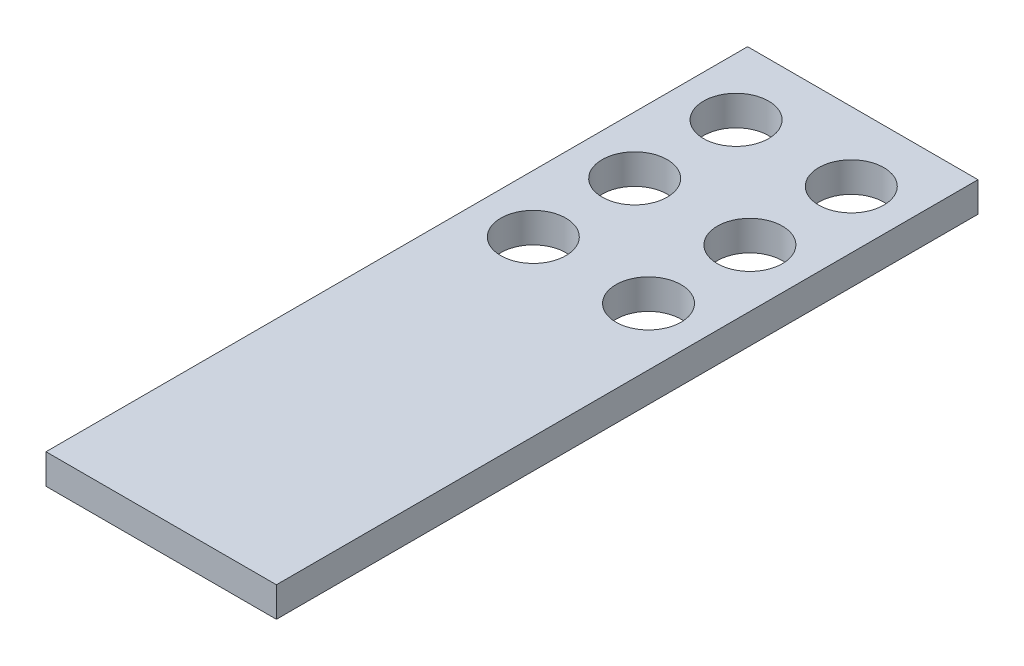
ISO-10303-21;
HEADER;
FILE_DESCRIPTION(('STEP AP214'),'2;1');
FILE_NAME('part.step','',(''),(''),'','','');
FILE_SCHEMA(('AUTOMOTIVE_DESIGN { 1 0 10303 214 1 1 1 1 }'));
ENDSEC;
DATA;
#1=APPLICATION_CONTEXT('core data for automotive mechanical design processes');
#2=APPLICATION_PROTOCOL_DEFINITION('international standard','automotive_design',2000,#1);
#3=PRODUCT_CONTEXT('',#1,'mechanical');
#4=PRODUCT('Part','Part','',(#3));
#5=PRODUCT_RELATED_PRODUCT_CATEGORY('part','',(#4));
#6=PRODUCT_DEFINITION_FORMATION('','',#4);
#7=PRODUCT_DEFINITION_CONTEXT('part definition',#1,'design');
#8=PRODUCT_DEFINITION('design','',#6,#7);
#9=PRODUCT_DEFINITION_SHAPE('','',#8);
#10=(LENGTH_UNIT() NAMED_UNIT(*) SI_UNIT(.MILLI.,.METRE.));
#11=(NAMED_UNIT(*) PLANE_ANGLE_UNIT() SI_UNIT($,.RADIAN.));
#12=(NAMED_UNIT(*) SI_UNIT($,.STERADIAN.) SOLID_ANGLE_UNIT());
#13=UNCERTAINTY_MEASURE_WITH_UNIT(LENGTH_MEASURE(1.E-05),#10,'distance_accuracy_value','');
#14=(GEOMETRIC_REPRESENTATION_CONTEXT(3) GLOBAL_UNCERTAINTY_ASSIGNED_CONTEXT((#13)) GLOBAL_UNIT_ASSIGNED_CONTEXT((#10,
#11,#12)) REPRESENTATION_CONTEXT('',''));
#15=CARTESIAN_POINT('',(0.,0.,0.));
#16=DIRECTION('',(0.,0.,1.));
#17=DIRECTION('',(1.,0.,0.));
#18=AXIS2_PLACEMENT_3D('',#15,#16,#17);
#19=CARTESIAN_POINT('',(0.,26.,0.));
#20=DIRECTION('',(0.,1.,0.));
#21=DIRECTION('',(0.,0.,1.));
#22=AXIS2_PLACEMENT_3D('',#19,#20,#21);
#23=PLANE('',#22);
#24=CARTESIAN_POINT('',(50.,26.,236.));
#25=DIRECTION('',(0.,1.,0.));
#26=DIRECTION('',(0.,0.,1.));
#27=AXIS2_PLACEMENT_3D('',#24,#25,#26);
#28=CIRCLE('',#27,28.25);
#29=CARTESIAN_POINT('',(50.,26.,264.25));
#30=VERTEX_POINT('',#29);
#31=EDGE_CURVE('E271',#30,#30,#28,.T.);
#32=ORIENTED_EDGE('',*,*,#31,.F.);
#33=EDGE_LOOP('',(#32));
#34=FACE_BOUND('',#33,.T.);
#35=CARTESIAN_POINT('',(50.,26.,148.));
#36=DIRECTION('',(0.,1.,0.));
#37=DIRECTION('',(0.,0.,1.));
#38=AXIS2_PLACEMENT_3D('',#35,#36,#37);
#39=CIRCLE('',#38,28.25);
#40=CARTESIAN_POINT('',(50.,26.,176.25));
#41=VERTEX_POINT('',#40);
#42=EDGE_CURVE('E125',#41,#41,#39,.T.);
#43=ORIENTED_EDGE('',*,*,#42,.F.);
#44=EDGE_LOOP('',(#43));
#45=FACE_BOUND('',#44,.T.);
#46=CARTESIAN_POINT('',(50.,26.,60.));
#47=DIRECTION('',(0.,1.,0.));
#48=DIRECTION('',(0.,0.,1.));
#49=AXIS2_PLACEMENT_3D('',#46,#47,#48);
#50=CIRCLE('',#49,28.25);
#51=CARTESIAN_POINT('',(50.,26.,88.25));
#52=VERTEX_POINT('',#51);
#53=EDGE_CURVE('E126',#52,#52,#50,.T.);
#54=ORIENTED_EDGE('',*,*,#53,.F.);
#55=EDGE_LOOP('',(#54));
#56=FACE_BOUND('',#55,.T.);
#57=DIRECTION('',(0.,0.,1.));
#58=VECTOR('',#57,1.);
#59=CARTESIAN_POINT('',(0.,26.,0.));
#60=LINE('',#59,#58);
#61=CARTESIAN_POINT('',(0.,26.,0.));
#62=VERTEX_POINT('',#61);
#63=CARTESIAN_POINT('',(0.,26.,609.));
#64=VERTEX_POINT('',#63);
#65=EDGE_CURVE('E88',#62,#64,#60,.T.);
#66=ORIENTED_EDGE('',*,*,#65,.T.);
#67=DIRECTION('',(1.,0.,0.));
#68=VECTOR('',#67,1.);
#69=CARTESIAN_POINT('',(0.,26.,609.));
#70=LINE('',#69,#68);
#71=CARTESIAN_POINT('',(200.,26.,609.));
#72=VERTEX_POINT('',#71);
#73=EDGE_CURVE('E83',#64,#72,#70,.T.);
#74=ORIENTED_EDGE('',*,*,#73,.T.);
#75=DIRECTION('',(0.,0.,-1.));
#76=VECTOR('',#75,1.);
#77=CARTESIAN_POINT('',(200.,26.,0.));
#78=LINE('',#77,#76);
#79=CARTESIAN_POINT('',(200.,26.,0.));
#80=VERTEX_POINT('',#79);
#81=EDGE_CURVE('E86',#72,#80,#78,.T.);
#82=ORIENTED_EDGE('',*,*,#81,.T.);
#83=DIRECTION('',(-1.,0.,0.));
#84=VECTOR('',#83,1.);
#85=CARTESIAN_POINT('',(0.,26.,0.));
#86=LINE('',#85,#84);
#87=EDGE_CURVE('E53',#80,#62,#86,.T.);
#88=ORIENTED_EDGE('',*,*,#87,.T.);
#89=EDGE_LOOP('',(#66,#74,#82,#88));
#90=FACE_BOUND('',#89,.T.);
#91=CARTESIAN_POINT('',(150.,26.,60.));
#92=DIRECTION('',(0.,1.,0.));
#93=DIRECTION('',(0.,0.,1.));
#94=AXIS2_PLACEMENT_3D('',#91,#92,#93);
#95=CIRCLE('',#94,28.25);
#96=CARTESIAN_POINT('',(150.,26.,88.25));
#97=VERTEX_POINT('',#96);
#98=EDGE_CURVE('E113',#97,#97,#95,.T.);
#99=ORIENTED_EDGE('',*,*,#98,.F.);
#100=EDGE_LOOP('',(#99));
#101=FACE_BOUND('',#100,.T.);
#102=CARTESIAN_POINT('',(150.,26.,148.));
#103=DIRECTION('',(0.,1.,0.));
#104=DIRECTION('',(0.,0.,1.));
#105=AXIS2_PLACEMENT_3D('',#102,#103,#104);
#106=CIRCLE('',#105,28.25);
#107=CARTESIAN_POINT('',(150.,26.,176.25));
#108=VERTEX_POINT('',#107);
#109=EDGE_CURVE('E278',#108,#108,#106,.T.);
#110=ORIENTED_EDGE('',*,*,#109,.F.);
#111=EDGE_LOOP('',(#110));
#112=FACE_BOUND('',#111,.T.);
#113=CARTESIAN_POINT('',(150.,26.,236.));
#114=DIRECTION('',(0.,1.,0.));
#115=DIRECTION('',(0.,0.,1.));
#116=AXIS2_PLACEMENT_3D('',#113,#114,#115);
#117=CIRCLE('',#116,28.25);
#118=CARTESIAN_POINT('',(150.,26.,264.25));
#119=VERTEX_POINT('',#118);
#120=EDGE_CURVE('E261',#119,#119,#117,.T.);
#121=ORIENTED_EDGE('',*,*,#120,.F.);
#122=EDGE_LOOP('',(#121));
#123=FACE_BOUND('',#122,.T.);
#124=ADVANCED_FACE('F36',(#34,#45,#56,#90,#101,#112,#123),#23,.T.);
#125=CARTESIAN_POINT('',(0.,0.,0.));
#126=DIRECTION('',(0.,1.,0.));
#127=DIRECTION('',(0.,0.,1.));
#128=AXIS2_PLACEMENT_3D('',#125,#126,#127);
#129=PLANE('',#128);
#130=DIRECTION('',(0.,0.,1.));
#131=VECTOR('',#130,1.);
#132=CARTESIAN_POINT('',(0.,0.,0.));
#133=LINE('',#132,#131);
#134=CARTESIAN_POINT('',(0.,0.,0.));
#135=VERTEX_POINT('',#134);
#136=CARTESIAN_POINT('',(0.,0.,609.));
#137=VERTEX_POINT('',#136);
#138=EDGE_CURVE('E131',#135,#137,#133,.T.);
#139=ORIENTED_EDGE('',*,*,#138,.F.);
#140=DIRECTION('',(-1.,0.,0.));
#141=VECTOR('',#140,1.);
#142=CARTESIAN_POINT('',(0.,0.,0.));
#143=LINE('',#142,#141);
#144=CARTESIAN_POINT('',(200.,0.,0.));
#145=VERTEX_POINT('',#144);
#146=EDGE_CURVE('E76',#145,#135,#143,.T.);
#147=ORIENTED_EDGE('',*,*,#146,.F.);
#148=DIRECTION('',(0.,0.,-1.));
#149=VECTOR('',#148,1.);
#150=CARTESIAN_POINT('',(200.,0.,0.));
#151=LINE('',#150,#149);
#152=CARTESIAN_POINT('',(200.,0.,609.));
#153=VERTEX_POINT('',#152);
#154=EDGE_CURVE('E70',#153,#145,#151,.T.);
#155=ORIENTED_EDGE('',*,*,#154,.F.);
#156=DIRECTION('',(1.,0.,0.));
#157=VECTOR('',#156,1.);
#158=CARTESIAN_POINT('',(0.,0.,609.));
#159=LINE('',#158,#157);
#160=EDGE_CURVE('E93',#137,#153,#159,.T.);
#161=ORIENTED_EDGE('',*,*,#160,.F.);
#162=EDGE_LOOP('',(#139,#147,#155,#161));
#163=FACE_BOUND('',#162,.T.);
#164=CARTESIAN_POINT('',(50.,0.,60.));
#165=DIRECTION('',(0.,1.,0.));
#166=DIRECTION('',(0.,0.,1.));
#167=AXIS2_PLACEMENT_3D('',#164,#165,#166);
#168=CIRCLE('',#167,28.25);
#169=CARTESIAN_POINT('',(50.,0.,88.25));
#170=VERTEX_POINT('',#169);
#171=EDGE_CURVE('E119',#170,#170,#168,.T.);
#172=ORIENTED_EDGE('',*,*,#171,.T.);
#173=EDGE_LOOP('',(#172));
#174=FACE_BOUND('',#173,.T.);
#175=CARTESIAN_POINT('',(150.,0.,60.));
#176=DIRECTION('',(0.,1.,0.));
#177=DIRECTION('',(0.,0.,1.));
#178=AXIS2_PLACEMENT_3D('',#175,#176,#177);
#179=CIRCLE('',#178,28.25);
#180=CARTESIAN_POINT('',(150.,0.,88.25));
#181=VERTEX_POINT('',#180);
#182=EDGE_CURVE('E120',#181,#181,#179,.T.);
#183=ORIENTED_EDGE('',*,*,#182,.T.);
#184=EDGE_LOOP('',(#183));
#185=FACE_BOUND('',#184,.T.);
#186=CARTESIAN_POINT('',(50.,0.,148.));
#187=DIRECTION('',(0.,1.,0.));
#188=DIRECTION('',(0.,0.,1.));
#189=AXIS2_PLACEMENT_3D('',#186,#187,#188);
#190=CIRCLE('',#189,28.25);
#191=CARTESIAN_POINT('',(50.,0.,176.25));
#192=VERTEX_POINT('',#191);
#193=EDGE_CURVE('E121',#192,#192,#190,.T.);
#194=ORIENTED_EDGE('',*,*,#193,.T.);
#195=EDGE_LOOP('',(#194));
#196=FACE_BOUND('',#195,.T.);
#197=CARTESIAN_POINT('',(150.,0.,148.));
#198=DIRECTION('',(0.,1.,0.));
#199=DIRECTION('',(0.,0.,1.));
#200=AXIS2_PLACEMENT_3D('',#197,#198,#199);
#201=CIRCLE('',#200,28.25);
#202=CARTESIAN_POINT('',(150.,0.,176.25));
#203=VERTEX_POINT('',#202);
#204=EDGE_CURVE('E276',#203,#203,#201,.T.);
#205=ORIENTED_EDGE('',*,*,#204,.T.);
#206=EDGE_LOOP('',(#205));
#207=FACE_BOUND('',#206,.T.);
#208=CARTESIAN_POINT('',(50.,0.,236.));
#209=DIRECTION('',(0.,1.,0.));
#210=DIRECTION('',(0.,0.,1.));
#211=AXIS2_PLACEMENT_3D('',#208,#209,#210);
#212=CIRCLE('',#211,28.25);
#213=CARTESIAN_POINT('',(50.,0.,264.25));
#214=VERTEX_POINT('',#213);
#215=EDGE_CURVE('E268',#214,#214,#212,.T.);
#216=ORIENTED_EDGE('',*,*,#215,.T.);
#217=EDGE_LOOP('',(#216));
#218=FACE_BOUND('',#217,.T.);
#219=CARTESIAN_POINT('',(150.,0.,236.));
#220=DIRECTION('',(0.,1.,0.));
#221=DIRECTION('',(0.,0.,1.));
#222=AXIS2_PLACEMENT_3D('',#219,#220,#221);
#223=CIRCLE('',#222,28.25);
#224=CARTESIAN_POINT('',(150.,0.,264.25));
#225=VERTEX_POINT('',#224);
#226=EDGE_CURVE('E264',#225,#225,#223,.T.);
#227=ORIENTED_EDGE('',*,*,#226,.T.);
#228=EDGE_LOOP('',(#227));
#229=FACE_BOUND('',#228,.T.);
#230=ADVANCED_FACE('F145',(#163,#174,#185,#196,#207,#218,#229),#129,.F.);
#231=CARTESIAN_POINT('',(0.,26.,0.));
#232=DIRECTION('',(1.,0.,0.));
#233=DIRECTION('',(0.,0.,-1.));
#234=AXIS2_PLACEMENT_3D('',#231,#232,#233);
#235=PLANE('',#234);
#236=ORIENTED_EDGE('',*,*,#138,.T.);
#237=DIRECTION('',(0.,-1.,0.));
#238=VECTOR('',#237,1.);
#239=CARTESIAN_POINT('',(0.,26.,609.));
#240=LINE('',#239,#238);
#241=EDGE_CURVE('E12',#64,#137,#240,.T.);
#242=ORIENTED_EDGE('',*,*,#241,.F.);
#243=ORIENTED_EDGE('',*,*,#65,.F.);
#244=DIRECTION('',(0.,-1.,0.));
#245=VECTOR('',#244,1.);
#246=CARTESIAN_POINT('',(0.,26.,0.));
#247=LINE('',#246,#245);
#248=EDGE_CURVE('E99',#62,#135,#247,.T.);
#249=ORIENTED_EDGE('',*,*,#248,.T.);
#250=EDGE_LOOP('',(#236,#242,#243,#249));
#251=FACE_BOUND('',#250,.T.);
#252=ADVANCED_FACE('F38',(#251),#235,.F.);
#253=CARTESIAN_POINT('',(0.,26.,609.));
#254=DIRECTION('',(0.,0.,-1.));
#255=DIRECTION('',(-1.,0.,0.));
#256=AXIS2_PLACEMENT_3D('',#253,#254,#255);
#257=PLANE('',#256);
#258=ORIENTED_EDGE('',*,*,#160,.T.);
#259=DIRECTION('',(0.,-1.,0.));
#260=VECTOR('',#259,1.);
#261=CARTESIAN_POINT('',(200.,26.,609.));
#262=LINE('',#261,#260);
#263=EDGE_CURVE('E45',#72,#153,#262,.T.);
#264=ORIENTED_EDGE('',*,*,#263,.F.);
#265=ORIENTED_EDGE('',*,*,#73,.F.);
#266=ORIENTED_EDGE('',*,*,#241,.T.);
#267=EDGE_LOOP('',(#258,#264,#265,#266));
#268=FACE_BOUND('',#267,.T.);
#269=ADVANCED_FACE('F92',(#268),#257,.F.);
#270=CARTESIAN_POINT('',(200.,26.,0.));
#271=DIRECTION('',(-1.,0.,0.));
#272=DIRECTION('',(0.,0.,1.));
#273=AXIS2_PLACEMENT_3D('',#270,#271,#272);
#274=PLANE('',#273);
#275=ORIENTED_EDGE('',*,*,#154,.T.);
#276=DIRECTION('',(0.,-1.,0.));
#277=VECTOR('',#276,1.);
#278=CARTESIAN_POINT('',(200.,26.,0.));
#279=LINE('',#278,#277);
#280=EDGE_CURVE('E94',#80,#145,#279,.T.);
#281=ORIENTED_EDGE('',*,*,#280,.F.);
#282=ORIENTED_EDGE('',*,*,#81,.F.);
#283=ORIENTED_EDGE('',*,*,#263,.T.);
#284=EDGE_LOOP('',(#275,#281,#282,#283));
#285=FACE_BOUND('',#284,.T.);
#286=ADVANCED_FACE('F95',(#285),#274,.F.);
#287=CARTESIAN_POINT('',(0.,26.,0.));
#288=DIRECTION('',(0.,0.,1.));
#289=DIRECTION('',(1.,0.,0.));
#290=AXIS2_PLACEMENT_3D('',#287,#288,#289);
#291=PLANE('',#290);
#292=ORIENTED_EDGE('',*,*,#146,.T.);
#293=ORIENTED_EDGE('',*,*,#248,.F.);
#294=ORIENTED_EDGE('',*,*,#87,.F.);
#295=ORIENTED_EDGE('',*,*,#280,.T.);
#296=EDGE_LOOP('',(#292,#293,#294,#295));
#297=FACE_BOUND('',#296,.T.);
#298=ADVANCED_FACE('F142',(#297),#291,.F.);
#299=CARTESIAN_POINT('',(50.,26.,60.));
#300=DIRECTION('',(0.,-1.,0.));
#301=DIRECTION('',(0.,0.,-1.));
#302=AXIS2_PLACEMENT_3D('',#299,#300,#301);
#303=CYLINDRICAL_SURFACE('',#302,28.25);
#304=ORIENTED_EDGE('',*,*,#53,.T.);
#305=EDGE_LOOP('',(#304));
#306=FACE_BOUND('',#305,.T.);
#307=ORIENTED_EDGE('',*,*,#171,.F.);
#308=EDGE_LOOP('',(#307));
#309=FACE_BOUND('',#308,.T.);
#310=ADVANCED_FACE('F163',(#306,#309),#303,.F.);
#311=CARTESIAN_POINT('',(150.,26.,60.));
#312=DIRECTION('',(0.,-1.,0.));
#313=DIRECTION('',(0.,0.,-1.));
#314=AXIS2_PLACEMENT_3D('',#311,#312,#313);
#315=CYLINDRICAL_SURFACE('',#314,28.25);
#316=ORIENTED_EDGE('',*,*,#98,.T.);
#317=EDGE_LOOP('',(#316));
#318=FACE_BOUND('',#317,.T.);
#319=ORIENTED_EDGE('',*,*,#182,.F.);
#320=EDGE_LOOP('',(#319));
#321=FACE_BOUND('',#320,.T.);
#322=ADVANCED_FACE('F183',(#318,#321),#315,.F.);
#323=CARTESIAN_POINT('',(50.,26.,148.));
#324=DIRECTION('',(0.,-1.,0.));
#325=DIRECTION('',(0.,0.,-1.));
#326=AXIS2_PLACEMENT_3D('',#323,#324,#325);
#327=CYLINDRICAL_SURFACE('',#326,28.25);
#328=ORIENTED_EDGE('',*,*,#42,.T.);
#329=EDGE_LOOP('',(#328));
#330=FACE_BOUND('',#329,.T.);
#331=ORIENTED_EDGE('',*,*,#193,.F.);
#332=EDGE_LOOP('',(#331));
#333=FACE_BOUND('',#332,.T.);
#334=ADVANCED_FACE('F190',(#330,#333),#327,.F.);
#335=CARTESIAN_POINT('',(150.,26.,148.));
#336=DIRECTION('',(0.,-1.,0.));
#337=DIRECTION('',(0.,0.,-1.));
#338=AXIS2_PLACEMENT_3D('',#335,#336,#337);
#339=CYLINDRICAL_SURFACE('',#338,28.25);
#340=ORIENTED_EDGE('',*,*,#109,.T.);
#341=EDGE_LOOP('',(#340));
#342=FACE_BOUND('',#341,.T.);
#343=ORIENTED_EDGE('',*,*,#204,.F.);
#344=EDGE_LOOP('',(#343));
#345=FACE_BOUND('',#344,.T.);
#346=ADVANCED_FACE('F197',(#342,#345),#339,.F.);
#347=CARTESIAN_POINT('',(50.,26.,236.));
#348=DIRECTION('',(0.,-1.,0.));
#349=DIRECTION('',(0.,0.,-1.));
#350=AXIS2_PLACEMENT_3D('',#347,#348,#349);
#351=CYLINDRICAL_SURFACE('',#350,28.25);
#352=ORIENTED_EDGE('',*,*,#31,.T.);
#353=EDGE_LOOP('',(#352));
#354=FACE_BOUND('',#353,.T.);
#355=ORIENTED_EDGE('',*,*,#215,.F.);
#356=EDGE_LOOP('',(#355));
#357=FACE_BOUND('',#356,.T.);
#358=ADVANCED_FACE('F205',(#354,#357),#351,.F.);
#359=CARTESIAN_POINT('',(150.,26.,236.));
#360=DIRECTION('',(0.,-1.,0.));
#361=DIRECTION('',(0.,0.,-1.));
#362=AXIS2_PLACEMENT_3D('',#359,#360,#361);
#363=CYLINDRICAL_SURFACE('',#362,28.25);
#364=ORIENTED_EDGE('',*,*,#120,.T.);
#365=EDGE_LOOP('',(#364));
#366=FACE_BOUND('',#365,.T.);
#367=ORIENTED_EDGE('',*,*,#226,.F.);
#368=EDGE_LOOP('',(#367));
#369=FACE_BOUND('',#368,.T.);
#370=ADVANCED_FACE('F213',(#366,#369),#363,.F.);
#371=CLOSED_SHELL('',(#124,#230,#252,#269,#286,#298,#310,#322,#334,#346,#358,#370));
#372=MANIFOLD_SOLID_BREP('B2',#371);
#373=ADVANCED_BREP_SHAPE_REPRESENTATION('',(#18,#372),#14);
#374=SHAPE_DEFINITION_REPRESENTATION(#9,#373);
ENDSEC;
END-ISO-10303-21;
